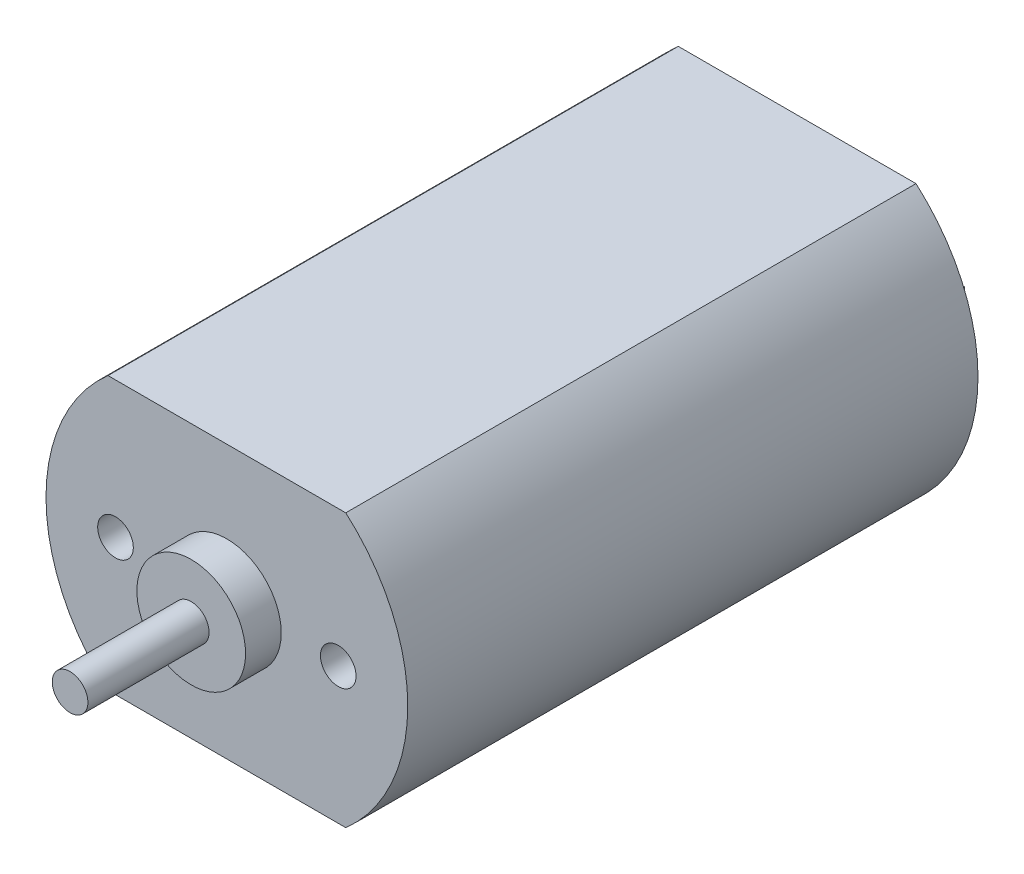
ISO-10303-21;
HEADER;
FILE_DESCRIPTION(('STEP AP214'),'2;1');
FILE_NAME('part.step','',(''),(''),'','','');
FILE_SCHEMA(('AUTOMOTIVE_DESIGN { 1 0 10303 214 1 1 1 1 }'));
ENDSEC;
DATA;
#1=APPLICATION_CONTEXT('core data for automotive mechanical design processes');
#2=APPLICATION_PROTOCOL_DEFINITION('international standard','automotive_design',2000,#1);
#3=PRODUCT_CONTEXT('',#1,'mechanical');
#4=PRODUCT('Part','Part','',(#3));
#5=PRODUCT_RELATED_PRODUCT_CATEGORY('part','',(#4));
#6=PRODUCT_DEFINITION_FORMATION('','',#4);
#7=PRODUCT_DEFINITION_CONTEXT('part definition',#1,'design');
#8=PRODUCT_DEFINITION('design','',#6,#7);
#9=PRODUCT_DEFINITION_SHAPE('','',#8);
#10=(LENGTH_UNIT() NAMED_UNIT(*) SI_UNIT(.MILLI.,.METRE.));
#11=(NAMED_UNIT(*) PLANE_ANGLE_UNIT() SI_UNIT($,.RADIAN.));
#12=(NAMED_UNIT(*) SI_UNIT($,.STERADIAN.) SOLID_ANGLE_UNIT());
#13=UNCERTAINTY_MEASURE_WITH_UNIT(LENGTH_MEASURE(1.E-05),#10,'distance_accuracy_value','');
#14=(GEOMETRIC_REPRESENTATION_CONTEXT(3) GLOBAL_UNCERTAINTY_ASSIGNED_CONTEXT((#13)) GLOBAL_UNIT_ASSIGNED_CONTEXT((#10,
#11,#12)) REPRESENTATION_CONTEXT('',''));
#15=CARTESIAN_POINT('',(0.,0.,0.));
#16=DIRECTION('',(0.,0.,1.));
#17=DIRECTION('',(1.,0.,0.));
#18=AXIS2_PLACEMENT_3D('',#15,#16,#17);
#19=CARTESIAN_POINT('',(0.,0.,0.));
#20=DIRECTION('',(0.,0.,1.));
#21=DIRECTION('',(1.,0.,0.));
#22=AXIS2_PLACEMENT_3D('',#19,#20,#21);
#23=PLANE('',#22);
#24=DIRECTION('',(1.,0.,0.));
#25=VECTOR('',#24,1.);
#26=CARTESIAN_POINT('',(-6.40000000000018,0.999999999996614,0.));
#27=LINE('',#26,#25);
#28=CARTESIAN_POINT('',(-6.40000000000018,0.999999999996614,0.));
#29=VERTEX_POINT('',#28);
#30=CARTESIAN_POINT('',(-6.00000000000018,0.999999999996651,0.));
#31=VERTEX_POINT('',#30);
#32=EDGE_CURVE('E186',#29,#31,#27,.T.);
#33=ORIENTED_EDGE('',*,*,#32,.F.);
#34=DIRECTION('',(0.,1.,0.));
#35=VECTOR('',#34,1.);
#36=CARTESIAN_POINT('',(-6.39999999999999,-1.00000000000339,0.));
#37=LINE('',#36,#35);
#38=CARTESIAN_POINT('',(-6.39999999999999,-1.00000000000339,0.));
#39=VERTEX_POINT('',#38);
#40=EDGE_CURVE('E176',#39,#29,#37,.T.);
#41=ORIENTED_EDGE('',*,*,#40,.F.);
#42=DIRECTION('',(-1.,0.,0.));
#43=VECTOR('',#42,1.);
#44=CARTESIAN_POINT('',(-6.39999999999999,-1.00000000000339,0.));
#45=LINE('',#44,#43);
#46=CARTESIAN_POINT('',(-5.99999999999999,-1.00000000000335,0.));
#47=VERTEX_POINT('',#46);
#48=EDGE_CURVE('E179',#47,#39,#45,.T.);
#49=ORIENTED_EDGE('',*,*,#48,.F.);
#50=DIRECTION('',(0.,-1.,0.));
#51=VECTOR('',#50,1.);
#52=CARTESIAN_POINT('',(-5.99999999999999,-1.00000000000335,0.));
#53=LINE('',#52,#51);
#54=EDGE_CURVE('E183',#31,#47,#53,.T.);
#55=ORIENTED_EDGE('',*,*,#54,.F.);
#56=EDGE_LOOP('',(#33,#41,#49,#55));
#57=FACE_BOUND('',#56,.T.);
#58=CARTESIAN_POINT('',(0.,0.,0.));
#59=DIRECTION('',(0.,0.,1.));
#60=DIRECTION('',(1.,0.,0.));
#61=AXIS2_PLACEMENT_3D('',#58,#59,#60);
#62=CIRCLE('',#61,10.15);
#63=CARTESIAN_POINT('',(-6.67083203206316,7.65000000000001,0.));
#64=VERTEX_POINT('',#63);
#65=CARTESIAN_POINT('',(-6.67083203206317,-7.65,0.));
#66=VERTEX_POINT('',#65);
#67=EDGE_CURVE('E213',#64,#66,#62,.T.);
#68=ORIENTED_EDGE('',*,*,#67,.F.);
#69=DIRECTION('',(1.,0.,0.));
#70=VECTOR('',#69,1.);
#71=CARTESIAN_POINT('',(0.,7.65,0.));
#72=LINE('',#71,#70);
#73=CARTESIAN_POINT('',(6.67083203206317,7.65,0.));
#74=VERTEX_POINT('',#73);
#75=EDGE_CURVE('E196',#64,#74,#72,.T.);
#76=ORIENTED_EDGE('',*,*,#75,.T.);
#77=CARTESIAN_POINT('',(6.67083203206317,-7.65,0.));
#78=VERTEX_POINT('',#77);
#79=EDGE_CURVE('E45',#78,#74,#62,.T.);
#80=ORIENTED_EDGE('',*,*,#79,.F.);
#81=DIRECTION('',(1.,0.,0.));
#82=VECTOR('',#81,1.);
#83=CARTESIAN_POINT('',(0.,-7.65,0.));
#84=LINE('',#83,#82);
#85=EDGE_CURVE('E156',#66,#78,#84,.T.);
#86=ORIENTED_EDGE('',*,*,#85,.F.);
#87=EDGE_LOOP('',(#68,#76,#80,#86));
#88=FACE_BOUND('',#87,.T.);
#89=DIRECTION('',(0.,1.,0.));
#90=VECTOR('',#89,1.);
#91=CARTESIAN_POINT('',(6.,1.,0.));
#92=LINE('',#91,#90);
#93=CARTESIAN_POINT('',(6.,-1.,0.));
#94=VERTEX_POINT('',#93);
#95=CARTESIAN_POINT('',(6.,1.,0.));
#96=VERTEX_POINT('',#95);
#97=EDGE_CURVE('E152',#94,#96,#92,.T.);
#98=ORIENTED_EDGE('',*,*,#97,.F.);
#99=DIRECTION('',(-1.,0.,0.));
#100=VECTOR('',#99,1.);
#101=CARTESIAN_POINT('',(6.4,-1.,0.));
#102=LINE('',#101,#100);
#103=CARTESIAN_POINT('',(6.4,-1.,0.));
#104=VERTEX_POINT('',#103);
#105=EDGE_CURVE('E149',#104,#94,#102,.T.);
#106=ORIENTED_EDGE('',*,*,#105,.F.);
#107=DIRECTION('',(0.,-1.,0.));
#108=VECTOR('',#107,1.);
#109=CARTESIAN_POINT('',(6.4,1.,0.));
#110=LINE('',#109,#108);
#111=CARTESIAN_POINT('',(6.4,1.,0.));
#112=VERTEX_POINT('',#111);
#113=EDGE_CURVE('E63',#112,#104,#110,.T.);
#114=ORIENTED_EDGE('',*,*,#113,.F.);
#115=DIRECTION('',(1.,0.,0.));
#116=VECTOR('',#115,1.);
#117=CARTESIAN_POINT('',(6.4,1.,0.));
#118=LINE('',#117,#116);
#119=EDGE_CURVE('E58',#96,#112,#118,.T.);
#120=ORIENTED_EDGE('',*,*,#119,.F.);
#121=EDGE_LOOP('',(#98,#106,#114,#120));
#122=FACE_BOUND('',#121,.T.);
#123=ADVANCED_FACE('F41',(#57,#88,#122),#23,.F.);
#124=CARTESIAN_POINT('',(0.,0.,32.));
#125=DIRECTION('',(0.,0.,-1.));
#126=DIRECTION('',(-1.,0.,0.));
#127=AXIS2_PLACEMENT_3D('',#124,#125,#126);
#128=CYLINDRICAL_SURFACE('',#127,10.15);
#129=CARTESIAN_POINT('',(0.,0.,32.));
#130=DIRECTION('',(0.,0.,1.));
#131=DIRECTION('',(1.,0.,0.));
#132=AXIS2_PLACEMENT_3D('',#129,#130,#131);
#133=CIRCLE('',#132,10.15);
#134=CARTESIAN_POINT('',(-6.67083203206316,7.65000000000001,32.));
#135=VERTEX_POINT('',#134);
#136=CARTESIAN_POINT('',(-6.67083203206317,-7.65,32.));
#137=VERTEX_POINT('',#136);
#138=EDGE_CURVE('E50',#135,#137,#133,.T.);
#139=ORIENTED_EDGE('',*,*,#138,.F.);
#140=DIRECTION('',(0.,0.,1.));
#141=VECTOR('',#140,1.);
#142=CARTESIAN_POINT('',(-6.67083203206316,7.65000000000001,0.));
#143=LINE('',#142,#141);
#144=EDGE_CURVE('E199',#64,#135,#143,.T.);
#145=ORIENTED_EDGE('',*,*,#144,.F.);
#146=ORIENTED_EDGE('',*,*,#67,.T.);
#147=DIRECTION('',(0.,0.,1.));
#148=VECTOR('',#147,1.);
#149=CARTESIAN_POINT('',(-6.67083203206317,-7.65,0.));
#150=LINE('',#149,#148);
#151=EDGE_CURVE('E207',#66,#137,#150,.T.);
#152=ORIENTED_EDGE('',*,*,#151,.T.);
#153=EDGE_LOOP('',(#139,#145,#146,#152));
#154=FACE_BOUND('',#153,.T.);
#155=ADVANCED_FACE('F43',(#154),#128,.T.);
#156=ORIENTED_EDGE('',*,*,#79,.T.);
#157=DIRECTION('',(0.,0.,1.));
#158=VECTOR('',#157,1.);
#159=CARTESIAN_POINT('',(6.67083203206317,7.65,0.));
#160=LINE('',#159,#158);
#161=CARTESIAN_POINT('',(6.67083203206317,7.65,32.));
#162=VERTEX_POINT('',#161);
#163=EDGE_CURVE('E203',#74,#162,#160,.T.);
#164=ORIENTED_EDGE('',*,*,#163,.T.);
#165=CARTESIAN_POINT('',(6.67083203206317,-7.65,32.));
#166=VERTEX_POINT('',#165);
#167=EDGE_CURVE('E211',#166,#162,#133,.T.);
#168=ORIENTED_EDGE('',*,*,#167,.F.);
#169=DIRECTION('',(0.,0.,1.));
#170=VECTOR('',#169,1.);
#171=CARTESIAN_POINT('',(6.67083203206317,-7.65,0.));
#172=LINE('',#171,#170);
#173=EDGE_CURVE('E202',#78,#166,#172,.T.);
#174=ORIENTED_EDGE('',*,*,#173,.F.);
#175=EDGE_LOOP('',(#156,#164,#168,#174));
#176=FACE_BOUND('',#175,.T.);
#177=ADVANCED_FACE('F226',(#176),#128,.T.);
#178=CARTESIAN_POINT('',(0.,0.,32.));
#179=DIRECTION('',(0.,0.,1.));
#180=DIRECTION('',(1.,0.,0.));
#181=AXIS2_PLACEMENT_3D('',#178,#179,#180);
#182=PLANE('',#181);
#183=CARTESIAN_POINT('',(0.,0.,32.));
#184=DIRECTION('',(0.,0.,1.));
#185=DIRECTION('',(1.,0.,0.));
#186=AXIS2_PLACEMENT_3D('',#183,#184,#185);
#187=CIRCLE('',#186,3.05);
#188=CARTESIAN_POINT('',(3.05,0.,32.));
#189=VERTEX_POINT('',#188);
#190=EDGE_CURVE('E334',#189,#189,#187,.T.);
#191=ORIENTED_EDGE('',*,*,#190,.F.);
#192=EDGE_LOOP('',(#191));
#193=FACE_BOUND('',#192,.T.);
#194=CARTESIAN_POINT('',(-6.25,0.,32.));
#195=DIRECTION('',(0.,0.,1.));
#196=DIRECTION('',(1.,0.,0.));
#197=AXIS2_PLACEMENT_3D('',#194,#195,#196);
#198=CIRCLE('',#197,1.);
#199=CARTESIAN_POINT('',(-5.25,0.,32.));
#200=VERTEX_POINT('',#199);
#201=EDGE_CURVE('E345',#200,#200,#198,.T.);
#202=ORIENTED_EDGE('',*,*,#201,.F.);
#203=EDGE_LOOP('',(#202));
#204=FACE_BOUND('',#203,.T.);
#205=CARTESIAN_POINT('',(6.25,0.,32.));
#206=DIRECTION('',(0.,0.,1.));
#207=DIRECTION('',(1.,0.,0.));
#208=AXIS2_PLACEMENT_3D('',#205,#206,#207);
#209=CIRCLE('',#208,1.);
#210=CARTESIAN_POINT('',(7.25,0.,32.));
#211=VERTEX_POINT('',#210);
#212=EDGE_CURVE('E341',#211,#211,#209,.T.);
#213=ORIENTED_EDGE('',*,*,#212,.F.);
#214=EDGE_LOOP('',(#213));
#215=FACE_BOUND('',#214,.T.);
#216=DIRECTION('',(1.,0.,0.));
#217=VECTOR('',#216,1.);
#218=CARTESIAN_POINT('',(0.,7.65,32.));
#219=LINE('',#218,#217);
#220=EDGE_CURVE('E200',#135,#162,#219,.T.);
#221=ORIENTED_EDGE('',*,*,#220,.F.);
#222=ORIENTED_EDGE('',*,*,#138,.T.);
#223=DIRECTION('',(1.,0.,0.));
#224=VECTOR('',#223,1.);
#225=CARTESIAN_POINT('',(0.,-7.65,32.));
#226=LINE('',#225,#224);
#227=EDGE_CURVE('E153',#137,#166,#226,.T.);
#228=ORIENTED_EDGE('',*,*,#227,.T.);
#229=ORIENTED_EDGE('',*,*,#167,.T.);
#230=EDGE_LOOP('',(#221,#222,#228,#229));
#231=FACE_BOUND('',#230,.T.);
#232=ADVANCED_FACE('F232',(#193,#204,#215,#231),#182,.T.);
#233=CARTESIAN_POINT('',(0.,-7.65,0.));
#234=DIRECTION('',(0.,-1.,0.));
#235=DIRECTION('',(0.,0.,-1.));
#236=AXIS2_PLACEMENT_3D('',#233,#234,#235);
#237=PLANE('',#236);
#238=ORIENTED_EDGE('',*,*,#227,.F.);
#239=ORIENTED_EDGE('',*,*,#151,.F.);
#240=ORIENTED_EDGE('',*,*,#85,.T.);
#241=ORIENTED_EDGE('',*,*,#173,.T.);
#242=EDGE_LOOP('',(#238,#239,#240,#241));
#243=FACE_BOUND('',#242,.T.);
#244=ADVANCED_FACE('F234',(#243),#237,.T.);
#245=CARTESIAN_POINT('',(0.,7.65,0.));
#246=DIRECTION('',(0.,-1.,0.));
#247=DIRECTION('',(0.,0.,-1.));
#248=AXIS2_PLACEMENT_3D('',#245,#246,#247);
#249=PLANE('',#248);
#250=ORIENTED_EDGE('',*,*,#220,.T.);
#251=ORIENTED_EDGE('',*,*,#163,.F.);
#252=ORIENTED_EDGE('',*,*,#75,.F.);
#253=ORIENTED_EDGE('',*,*,#144,.T.);
#254=EDGE_LOOP('',(#250,#251,#252,#253));
#255=FACE_BOUND('',#254,.T.);
#256=ADVANCED_FACE('F230',(#255),#249,.F.);
#257=CARTESIAN_POINT('',(-6.40000000000018,0.999999999996614,-3.));
#258=DIRECTION('',(0.,-1.,0.));
#259=DIRECTION('',(1.,0.,0.));
#260=AXIS2_PLACEMENT_3D('',#257,#258,#259);
#261=PLANE('',#260);
#262=ORIENTED_EDGE('',*,*,#32,.T.);
#263=DIRECTION('',(0.,0.,1.));
#264=VECTOR('',#263,1.);
#265=CARTESIAN_POINT('',(-6.00000000000018,0.999999999996651,-3.));
#266=LINE('',#265,#264);
#267=CARTESIAN_POINT('',(-6.00000000000018,0.999999999996651,-3.));
#268=VERTEX_POINT('',#267);
#269=EDGE_CURVE('E162',#268,#31,#266,.T.);
#270=ORIENTED_EDGE('',*,*,#269,.F.);
#271=DIRECTION('',(1.,0.,0.));
#272=VECTOR('',#271,1.);
#273=CARTESIAN_POINT('',(-6.40000000000018,0.999999999996614,-3.));
#274=LINE('',#273,#272);
#275=CARTESIAN_POINT('',(-6.40000000000018,0.999999999996614,-3.));
#276=VERTEX_POINT('',#275);
#277=EDGE_CURVE('E180',#276,#268,#274,.T.);
#278=ORIENTED_EDGE('',*,*,#277,.F.);
#279=DIRECTION('',(0.,0.,1.));
#280=VECTOR('',#279,1.);
#281=CARTESIAN_POINT('',(-6.40000000000018,0.999999999996614,-3.));
#282=LINE('',#281,#280);
#283=EDGE_CURVE('E172',#276,#29,#282,.T.);
#284=ORIENTED_EDGE('',*,*,#283,.T.);
#285=EDGE_LOOP('',(#262,#270,#278,#284));
#286=FACE_BOUND('',#285,.T.);
#287=ADVANCED_FACE('F241',(#286),#261,.F.);
#288=CARTESIAN_POINT('',(-5.99999999999999,-1.00000000000335,-3.));
#289=DIRECTION('',(-1.,0.,0.));
#290=DIRECTION('',(0.,-1.,0.));
#291=AXIS2_PLACEMENT_3D('',#288,#289,#290);
#292=PLANE('',#291);
#293=ORIENTED_EDGE('',*,*,#54,.T.);
#294=DIRECTION('',(0.,0.,1.));
#295=VECTOR('',#294,1.);
#296=CARTESIAN_POINT('',(-5.99999999999999,-1.00000000000335,-3.));
#297=LINE('',#296,#295);
#298=CARTESIAN_POINT('',(-5.99999999999999,-1.00000000000335,-3.));
#299=VERTEX_POINT('',#298);
#300=EDGE_CURVE('E165',#299,#47,#297,.T.);
#301=ORIENTED_EDGE('',*,*,#300,.F.);
#302=DIRECTION('',(0.,-1.,0.));
#303=VECTOR('',#302,1.);
#304=CARTESIAN_POINT('',(-5.99999999999999,-1.00000000000335,-3.));
#305=LINE('',#304,#303);
#306=EDGE_CURVE('E192',#268,#299,#305,.T.);
#307=ORIENTED_EDGE('',*,*,#306,.F.);
#308=ORIENTED_EDGE('',*,*,#269,.T.);
#309=EDGE_LOOP('',(#293,#301,#307,#308));
#310=FACE_BOUND('',#309,.T.);
#311=ADVANCED_FACE('F267',(#310),#292,.F.);
#312=CARTESIAN_POINT('',(-6.39999999999999,-1.00000000000339,-3.));
#313=DIRECTION('',(0.,1.,0.));
#314=DIRECTION('',(-1.,0.,0.));
#315=AXIS2_PLACEMENT_3D('',#312,#313,#314);
#316=PLANE('',#315);
#317=ORIENTED_EDGE('',*,*,#48,.T.);
#318=DIRECTION('',(0.,0.,1.));
#319=VECTOR('',#318,1.);
#320=CARTESIAN_POINT('',(-6.39999999999999,-1.00000000000339,-3.));
#321=LINE('',#320,#319);
#322=CARTESIAN_POINT('',(-6.39999999999999,-1.00000000000339,-3.));
#323=VERTEX_POINT('',#322);
#324=EDGE_CURVE('E169',#323,#39,#321,.T.);
#325=ORIENTED_EDGE('',*,*,#324,.F.);
#326=DIRECTION('',(-1.,0.,0.));
#327=VECTOR('',#326,1.);
#328=CARTESIAN_POINT('',(-6.39999999999999,-1.00000000000339,-3.));
#329=LINE('',#328,#327);
#330=EDGE_CURVE('E190',#299,#323,#329,.T.);
#331=ORIENTED_EDGE('',*,*,#330,.F.);
#332=ORIENTED_EDGE('',*,*,#300,.T.);
#333=EDGE_LOOP('',(#317,#325,#331,#332));
#334=FACE_BOUND('',#333,.T.);
#335=ADVANCED_FACE('F265',(#334),#316,.F.);
#336=CARTESIAN_POINT('',(-6.39999999999999,-1.00000000000339,-3.));
#337=DIRECTION('',(1.,0.,0.));
#338=DIRECTION('',(0.,1.,0.));
#339=AXIS2_PLACEMENT_3D('',#336,#337,#338);
#340=PLANE('',#339);
#341=ORIENTED_EDGE('',*,*,#40,.T.);
#342=ORIENTED_EDGE('',*,*,#283,.F.);
#343=DIRECTION('',(0.,1.,0.));
#344=VECTOR('',#343,1.);
#345=CARTESIAN_POINT('',(-6.39999999999999,-1.00000000000339,-3.));
#346=LINE('',#345,#344);
#347=EDGE_CURVE('E175',#323,#276,#346,.T.);
#348=ORIENTED_EDGE('',*,*,#347,.F.);
#349=ORIENTED_EDGE('',*,*,#324,.T.);
#350=EDGE_LOOP('',(#341,#342,#348,#349));
#351=FACE_BOUND('',#350,.T.);
#352=ADVANCED_FACE('F256',(#351),#340,.F.);
#353=CARTESIAN_POINT('',(0.,0.,-3.));
#354=DIRECTION('',(0.,0.,1.));
#355=DIRECTION('',(1.,0.,0.));
#356=AXIS2_PLACEMENT_3D('',#353,#354,#355);
#357=PLANE('',#356);
#358=ORIENTED_EDGE('',*,*,#277,.T.);
#359=ORIENTED_EDGE('',*,*,#306,.T.);
#360=ORIENTED_EDGE('',*,*,#330,.T.);
#361=ORIENTED_EDGE('',*,*,#347,.T.);
#362=EDGE_LOOP('',(#358,#359,#360,#361));
#363=FACE_BOUND('',#362,.T.);
#364=ADVANCED_FACE('F261',(#363),#357,.F.);
#365=CARTESIAN_POINT('',(6.,1.,-3.));
#366=DIRECTION('',(1.,0.,0.));
#367=DIRECTION('',(0.,0.,-1.));
#368=AXIS2_PLACEMENT_3D('',#365,#366,#367);
#369=PLANE('',#368);
#370=ORIENTED_EDGE('',*,*,#97,.T.);
#371=DIRECTION('',(0.,0.,1.));
#372=VECTOR('',#371,1.);
#373=CARTESIAN_POINT('',(6.,1.,-3.));
#374=LINE('',#373,#372);
#375=CARTESIAN_POINT('',(6.,1.,-3.));
#376=VERTEX_POINT('',#375);
#377=EDGE_CURVE('E133',#376,#96,#374,.T.);
#378=ORIENTED_EDGE('',*,*,#377,.F.);
#379=DIRECTION('',(0.,1.,0.));
#380=VECTOR('',#379,1.);
#381=CARTESIAN_POINT('',(6.,1.,-3.));
#382=LINE('',#381,#380);
#383=CARTESIAN_POINT('',(6.,-1.,-3.));
#384=VERTEX_POINT('',#383);
#385=EDGE_CURVE('E140',#384,#376,#382,.T.);
#386=ORIENTED_EDGE('',*,*,#385,.F.);
#387=DIRECTION('',(0.,0.,1.));
#388=VECTOR('',#387,1.);
#389=CARTESIAN_POINT('',(6.,-1.,-3.));
#390=LINE('',#389,#388);
#391=EDGE_CURVE('E355',#384,#94,#390,.T.);
#392=ORIENTED_EDGE('',*,*,#391,.T.);
#393=EDGE_LOOP('',(#370,#378,#386,#392));
#394=FACE_BOUND('',#393,.T.);
#395=ADVANCED_FACE('F151',(#394),#369,.F.);
#396=CARTESIAN_POINT('',(6.4,1.,-3.));
#397=DIRECTION('',(0.,-1.,0.));
#398=DIRECTION('',(1.,0.,0.));
#399=AXIS2_PLACEMENT_3D('',#396,#397,#398);
#400=PLANE('',#399);
#401=ORIENTED_EDGE('',*,*,#119,.T.);
#402=DIRECTION('',(0.,0.,1.));
#403=VECTOR('',#402,1.);
#404=CARTESIAN_POINT('',(6.4,1.,-3.));
#405=LINE('',#404,#403);
#406=CARTESIAN_POINT('',(6.4,1.,-3.));
#407=VERTEX_POINT('',#406);
#408=EDGE_CURVE('E136',#407,#112,#405,.T.);
#409=ORIENTED_EDGE('',*,*,#408,.F.);
#410=DIRECTION('',(1.,0.,0.));
#411=VECTOR('',#410,1.);
#412=CARTESIAN_POINT('',(6.4,1.,-3.));
#413=LINE('',#412,#411);
#414=EDGE_CURVE('E129',#376,#407,#413,.T.);
#415=ORIENTED_EDGE('',*,*,#414,.F.);
#416=ORIENTED_EDGE('',*,*,#377,.T.);
#417=EDGE_LOOP('',(#401,#409,#415,#416));
#418=FACE_BOUND('',#417,.T.);
#419=ADVANCED_FACE('F131',(#418),#400,.F.);
#420=CARTESIAN_POINT('',(6.4,1.,-3.));
#421=DIRECTION('',(-1.,0.,0.));
#422=DIRECTION('',(0.,0.,1.));
#423=AXIS2_PLACEMENT_3D('',#420,#421,#422);
#424=PLANE('',#423);
#425=ORIENTED_EDGE('',*,*,#113,.T.);
#426=DIRECTION('',(0.,0.,1.));
#427=VECTOR('',#426,1.);
#428=CARTESIAN_POINT('',(6.4,-1.,-3.));
#429=LINE('',#428,#427);
#430=CARTESIAN_POINT('',(6.4,-1.,-3.));
#431=VERTEX_POINT('',#430);
#432=EDGE_CURVE('E158',#431,#104,#429,.T.);
#433=ORIENTED_EDGE('',*,*,#432,.F.);
#434=DIRECTION('',(0.,-1.,0.));
#435=VECTOR('',#434,1.);
#436=CARTESIAN_POINT('',(6.4,1.,-3.));
#437=LINE('',#436,#435);
#438=EDGE_CURVE('E139',#407,#431,#437,.T.);
#439=ORIENTED_EDGE('',*,*,#438,.F.);
#440=ORIENTED_EDGE('',*,*,#408,.T.);
#441=EDGE_LOOP('',(#425,#433,#439,#440));
#442=FACE_BOUND('',#441,.T.);
#443=ADVANCED_FACE('F286',(#442),#424,.F.);
#444=CARTESIAN_POINT('',(6.4,-1.,-3.));
#445=DIRECTION('',(0.,1.,0.));
#446=DIRECTION('',(0.,0.,1.));
#447=AXIS2_PLACEMENT_3D('',#444,#445,#446);
#448=PLANE('',#447);
#449=ORIENTED_EDGE('',*,*,#105,.T.);
#450=ORIENTED_EDGE('',*,*,#391,.F.);
#451=DIRECTION('',(-1.,0.,0.));
#452=VECTOR('',#451,1.);
#453=CARTESIAN_POINT('',(6.4,-1.,-3.));
#454=LINE('',#453,#452);
#455=EDGE_CURVE('E145',#431,#384,#454,.T.);
#456=ORIENTED_EDGE('',*,*,#455,.F.);
#457=ORIENTED_EDGE('',*,*,#432,.T.);
#458=EDGE_LOOP('',(#449,#450,#456,#457));
#459=FACE_BOUND('',#458,.T.);
#460=ADVANCED_FACE('F291',(#459),#448,.F.);
#461=CARTESIAN_POINT('',(0.,0.,-3.));
#462=DIRECTION('',(0.,0.,-1.));
#463=DIRECTION('',(-1.,0.,0.));
#464=AXIS2_PLACEMENT_3D('',#461,#462,#463);
#465=PLANE('',#464);
#466=ORIENTED_EDGE('',*,*,#385,.T.);
#467=ORIENTED_EDGE('',*,*,#414,.T.);
#468=ORIENTED_EDGE('',*,*,#438,.T.);
#469=ORIENTED_EDGE('',*,*,#455,.T.);
#470=EDGE_LOOP('',(#466,#467,#468,#469));
#471=FACE_BOUND('',#470,.T.);
#472=ADVANCED_FACE('F143',(#471),#465,.T.);
#473=CARTESIAN_POINT('',(6.25,0.,28.));
#474=DIRECTION('',(0.,0.,1.));
#475=DIRECTION('',(1.,0.,0.));
#476=AXIS2_PLACEMENT_3D('',#473,#474,#475);
#477=CYLINDRICAL_SURFACE('',#476,1.);
#478=CARTESIAN_POINT('',(6.25,0.,28.));
#479=DIRECTION('',(0.,0.,1.));
#480=DIRECTION('',(1.,0.,0.));
#481=AXIS2_PLACEMENT_3D('',#478,#479,#480);
#482=CIRCLE('',#481,1.);
#483=CARTESIAN_POINT('',(7.25,0.,28.));
#484=VERTEX_POINT('',#483);
#485=EDGE_CURVE('E348',#484,#484,#482,.T.);
#486=ORIENTED_EDGE('',*,*,#485,.F.);
#487=EDGE_LOOP('',(#486));
#488=FACE_BOUND('',#487,.T.);
#489=ORIENTED_EDGE('',*,*,#212,.T.);
#490=EDGE_LOOP('',(#489));
#491=FACE_BOUND('',#490,.T.);
#492=ADVANCED_FACE('F298',(#488,#491),#477,.F.);
#493=CARTESIAN_POINT('',(0.,0.,28.));
#494=DIRECTION('',(0.,0.,1.));
#495=DIRECTION('',(1.,0.,0.));
#496=AXIS2_PLACEMENT_3D('',#493,#494,#495);
#497=PLANE('',#496);
#498=ORIENTED_EDGE('',*,*,#485,.T.);
#499=EDGE_LOOP('',(#498));
#500=FACE_BOUND('',#499,.T.);
#501=ADVANCED_FACE('F301',(#500),#497,.T.);
#502=CARTESIAN_POINT('',(-6.25,0.,28.));
#503=DIRECTION('',(0.,0.,1.));
#504=DIRECTION('',(1.,0.,0.));
#505=AXIS2_PLACEMENT_3D('',#502,#503,#504);
#506=CYLINDRICAL_SURFACE('',#505,1.);
#507=CARTESIAN_POINT('',(-6.25,0.,28.));
#508=DIRECTION('',(0.,0.,1.));
#509=DIRECTION('',(1.,0.,0.));
#510=AXIS2_PLACEMENT_3D('',#507,#508,#509);
#511=CIRCLE('',#510,1.);
#512=CARTESIAN_POINT('',(-5.25,0.,28.));
#513=VERTEX_POINT('',#512);
#514=EDGE_CURVE('E166',#513,#513,#511,.T.);
#515=ORIENTED_EDGE('',*,*,#514,.F.);
#516=EDGE_LOOP('',(#515));
#517=FACE_BOUND('',#516,.T.);
#518=ORIENTED_EDGE('',*,*,#201,.T.);
#519=EDGE_LOOP('',(#518));
#520=FACE_BOUND('',#519,.T.);
#521=ADVANCED_FACE('F305',(#517,#520),#506,.F.);
#522=CARTESIAN_POINT('',(0.,0.,28.));
#523=DIRECTION('',(0.,0.,1.));
#524=DIRECTION('',(1.,0.,0.));
#525=AXIS2_PLACEMENT_3D('',#522,#523,#524);
#526=PLANE('',#525);
#527=ORIENTED_EDGE('',*,*,#514,.T.);
#528=EDGE_LOOP('',(#527));
#529=FACE_BOUND('',#528,.T.);
#530=ADVANCED_FACE('F309',(#529),#526,.T.);
#531=CARTESIAN_POINT('',(0.,0.,34.));
#532=DIRECTION('',(0.,0.,-1.));
#533=DIRECTION('',(-1.,0.,0.));
#534=AXIS2_PLACEMENT_3D('',#531,#532,#533);
#535=CYLINDRICAL_SURFACE('',#534,3.05);
#536=CARTESIAN_POINT('',(0.,0.,34.));
#537=DIRECTION('',(0.,0.,1.));
#538=DIRECTION('',(1.,0.,0.));
#539=AXIS2_PLACEMENT_3D('',#536,#537,#538);
#540=CIRCLE('',#539,3.05);
#541=CARTESIAN_POINT('',(3.05,0.,34.));
#542=VERTEX_POINT('',#541);
#543=EDGE_CURVE('E337',#542,#542,#540,.T.);
#544=ORIENTED_EDGE('',*,*,#543,.F.);
#545=EDGE_LOOP('',(#544));
#546=FACE_BOUND('',#545,.T.);
#547=ORIENTED_EDGE('',*,*,#190,.T.);
#548=EDGE_LOOP('',(#547));
#549=FACE_BOUND('',#548,.T.);
#550=ADVANCED_FACE('F313',(#546,#549),#535,.T.);
#551=CARTESIAN_POINT('',(0.,0.,34.));
#552=DIRECTION('',(0.,0.,1.));
#553=DIRECTION('',(1.,0.,0.));
#554=AXIS2_PLACEMENT_3D('',#551,#552,#553);
#555=PLANE('',#554);
#556=CARTESIAN_POINT('',(0.,0.,34.));
#557=DIRECTION('',(0.,0.,1.));
#558=DIRECTION('',(1.,0.,0.));
#559=AXIS2_PLACEMENT_3D('',#556,#557,#558);
#560=CIRCLE('',#559,1.);
#561=CARTESIAN_POINT('',(1.,0.,34.));
#562=VERTEX_POINT('',#561);
#563=EDGE_CURVE('E11',#562,#562,#560,.T.);
#564=ORIENTED_EDGE('',*,*,#563,.F.);
#565=EDGE_LOOP('',(#564));
#566=FACE_BOUND('',#565,.T.);
#567=ORIENTED_EDGE('',*,*,#543,.T.);
#568=EDGE_LOOP('',(#567));
#569=FACE_BOUND('',#568,.T.);
#570=ADVANCED_FACE('F317',(#566,#569),#555,.T.);
#571=CARTESIAN_POINT('',(0.,0.,40.8));
#572=DIRECTION('',(0.,0.,-1.));
#573=DIRECTION('',(-1.,0.,0.));
#574=AXIS2_PLACEMENT_3D('',#571,#572,#573);
#575=CYLINDRICAL_SURFACE('',#574,1.);
#576=CARTESIAN_POINT('',(0.,0.,40.8));
#577=DIRECTION('',(0.,0.,1.));
#578=DIRECTION('',(1.,0.,0.));
#579=AXIS2_PLACEMENT_3D('',#576,#577,#578);
#580=CIRCLE('',#579,1.);
#581=CARTESIAN_POINT('',(1.,0.,40.8));
#582=VERTEX_POINT('',#581);
#583=EDGE_CURVE('E333',#582,#582,#580,.T.);
#584=ORIENTED_EDGE('',*,*,#583,.F.);
#585=EDGE_LOOP('',(#584));
#586=FACE_BOUND('',#585,.T.);
#587=ORIENTED_EDGE('',*,*,#563,.T.);
#588=EDGE_LOOP('',(#587));
#589=FACE_BOUND('',#588,.T.);
#590=ADVANCED_FACE('F321',(#586,#589),#575,.T.);
#591=CARTESIAN_POINT('',(0.,0.,40.8));
#592=DIRECTION('',(0.,0.,1.));
#593=DIRECTION('',(1.,0.,0.));
#594=AXIS2_PLACEMENT_3D('',#591,#592,#593);
#595=PLANE('',#594);
#596=ORIENTED_EDGE('',*,*,#583,.T.);
#597=EDGE_LOOP('',(#596));
#598=FACE_BOUND('',#597,.T.);
#599=ADVANCED_FACE('F325',(#598),#595,.T.);
#600=CLOSED_SHELL('',(#123,#155,#177,#232,#244,#256,#287,#311,#335,#352,#364,#395,#419,#443,
#460,#472,#492,#501,#521,#530,#550,#570,#590,#599));
#601=MANIFOLD_SOLID_BREP('B2',#600);
#602=ADVANCED_BREP_SHAPE_REPRESENTATION('',(#18,#601),#14);
#603=SHAPE_DEFINITION_REPRESENTATION(#9,#602);
ENDSEC;
END-ISO-10303-21;
